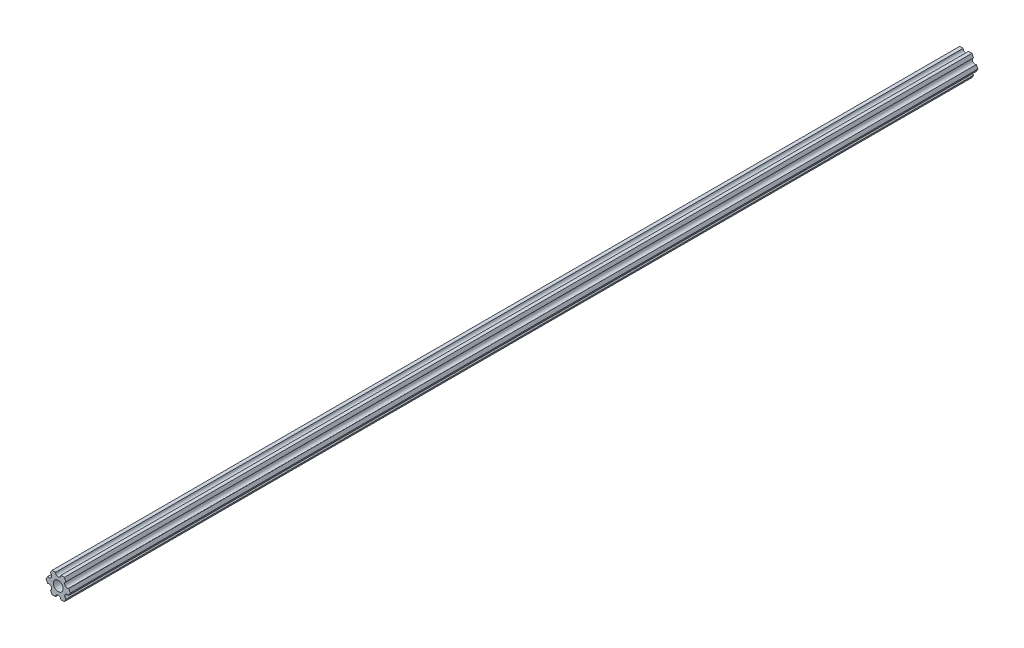
ISO-10303-21;
HEADER;
FILE_DESCRIPTION(('STEP AP214'),'2;1');
FILE_NAME('part.step','',(''),(''),'','','');
FILE_SCHEMA(('AUTOMOTIVE_DESIGN { 1 0 10303 214 1 1 1 1 }'));
ENDSEC;
DATA;
#1=APPLICATION_CONTEXT('core data for automotive mechanical design processes');
#2=APPLICATION_PROTOCOL_DEFINITION('international standard','automotive_design',2000,#1);
#3=PRODUCT_CONTEXT('',#1,'mechanical');
#4=PRODUCT('Part','Part','',(#3));
#5=PRODUCT_RELATED_PRODUCT_CATEGORY('part','',(#4));
#6=PRODUCT_DEFINITION_FORMATION('','',#4);
#7=PRODUCT_DEFINITION_CONTEXT('part definition',#1,'design');
#8=PRODUCT_DEFINITION('design','',#6,#7);
#9=PRODUCT_DEFINITION_SHAPE('','',#8);
#10=(LENGTH_UNIT() NAMED_UNIT(*) SI_UNIT(.MILLI.,.METRE.));
#11=(NAMED_UNIT(*) PLANE_ANGLE_UNIT() SI_UNIT($,.RADIAN.));
#12=(NAMED_UNIT(*) SI_UNIT($,.STERADIAN.) SOLID_ANGLE_UNIT());
#13=UNCERTAINTY_MEASURE_WITH_UNIT(LENGTH_MEASURE(1.E-05),#10,'distance_accuracy_value','');
#14=(GEOMETRIC_REPRESENTATION_CONTEXT(3) GLOBAL_UNCERTAINTY_ASSIGNED_CONTEXT((#13)) GLOBAL_UNIT_ASSIGNED_CONTEXT((#10,
#11,#12)) REPRESENTATION_CONTEXT('',''));
#15=CARTESIAN_POINT('',(0.,0.,0.));
#16=DIRECTION('',(0.,0.,1.));
#17=DIRECTION('',(1.,0.,0.));
#18=AXIS2_PLACEMENT_3D('',#15,#16,#17);
#19=CARTESIAN_POINT('',(5.49926150638083,-3.17499966684068,546.1));
#20=DIRECTION('',(0.,0.,-1.));
#21=DIRECTION('',(-1.,0.,0.));
#22=AXIS2_PLACEMENT_3D('',#19,#20,#21);
#23=CYLINDRICAL_SURFACE('',#22,1.58750000000001);
#24=CARTESIAN_POINT('',(5.49926150638083,-3.17499966684068,0.));
#25=DIRECTION('',(0.,0.,1.));
#26=DIRECTION('',(1.,0.,0.));
#27=AXIS2_PLACEMENT_3D('',#24,#25,#26);
#28=CIRCLE('',#27,1.58750000000001);
#29=CARTESIAN_POINT('',(6.29301142309098,-1.80018429024546,0.));
#30=VERTEX_POINT('',#29);
#31=CARTESIAN_POINT('',(4.70551158967068,-4.54981504343589,0.));
#32=VERTEX_POINT('',#31);
#33=EDGE_CURVE('E189',#30,#32,#28,.T.);
#34=ORIENTED_EDGE('',*,*,#33,.F.);
#35=DIRECTION('',(0.,0.,-1.));
#36=VECTOR('',#35,1.);
#37=CARTESIAN_POINT('',(6.29301142309098,-1.80018429024546,546.1));
#38=LINE('',#37,#36);
#39=CARTESIAN_POINT('',(6.29301142309098,-1.80018429024546,546.1));
#40=VERTEX_POINT('',#39);
#41=EDGE_CURVE('E11',#40,#30,#38,.T.);
#42=ORIENTED_EDGE('',*,*,#41,.F.);
#43=CARTESIAN_POINT('',(5.49926150638083,-3.17499966684068,546.1));
#44=DIRECTION('',(0.,0.,1.));
#45=DIRECTION('',(1.,0.,0.));
#46=AXIS2_PLACEMENT_3D('',#43,#44,#45);
#47=CIRCLE('',#46,1.58750000000001);
#48=CARTESIAN_POINT('',(4.70551158967068,-4.54981504343589,546.1));
#49=VERTEX_POINT('',#48);
#50=EDGE_CURVE('E240',#40,#49,#47,.T.);
#51=ORIENTED_EDGE('',*,*,#50,.T.);
#52=DIRECTION('',(0.,0.,-1.));
#53=VECTOR('',#52,1.);
#54=CARTESIAN_POINT('',(4.70551158967068,-4.54981504343589,546.1));
#55=LINE('',#54,#53);
#56=EDGE_CURVE('E35',#49,#32,#55,.T.);
#57=ORIENTED_EDGE('',*,*,#56,.T.);
#58=EDGE_LOOP('',(#34,#42,#51,#57));
#59=FACE_BOUND('',#58,.T.);
#60=ADVANCED_FACE('F32',(#59),#23,.F.);
#61=CARTESIAN_POINT('',(7.33234841870826,4.44212518856872E-07,546.1));
#62=DIRECTION('',(0.866025434075723,-0.499999947533953,0.));
#63=DIRECTION('',(0.499999947533953,0.866025434075723,0.));
#64=AXIS2_PLACEMENT_3D('',#61,#62,#63);
#65=PLANE('',#64);
#66=DIRECTION('',(-0.499999947533953,-0.866025434075723,0.));
#67=VECTOR('',#66,1.);
#68=CARTESIAN_POINT('',(7.33234841870826,4.44212518856872E-07,0.));
#69=LINE('',#68,#67);
#70=CARTESIAN_POINT('',(7.33234841870826,4.44212518856872E-07,0.));
#71=VERTEX_POINT('',#70);
#72=EDGE_CURVE('E238',#71,#30,#69,.T.);
#73=ORIENTED_EDGE('',*,*,#72,.F.);
#74=DIRECTION('',(0.,0.,-1.));
#75=VECTOR('',#74,1.);
#76=CARTESIAN_POINT('',(7.33234841870826,4.44212518856872E-07,546.1));
#77=LINE('',#76,#75);
#78=CARTESIAN_POINT('',(7.33234841870826,4.44212518856872E-07,546.1));
#79=VERTEX_POINT('',#78);
#80=EDGE_CURVE('E41',#79,#71,#77,.T.);
#81=ORIENTED_EDGE('',*,*,#80,.F.);
#82=DIRECTION('',(-0.499999947533953,-0.866025434075723,0.));
#83=VECTOR('',#82,1.);
#84=CARTESIAN_POINT('',(7.33234841870826,4.44212518856872E-07,546.1));
#85=LINE('',#84,#83);
#86=EDGE_CURVE('E179',#79,#40,#85,.T.);
#87=ORIENTED_EDGE('',*,*,#86,.T.);
#88=ORIENTED_EDGE('',*,*,#41,.T.);
#89=EDGE_LOOP('',(#73,#81,#87,#88));
#90=FACE_BOUND('',#89,.T.);
#91=ADVANCED_FACE('F272',(#90),#65,.T.);
#92=CARTESIAN_POINT('',(6.29301120497139,1.80018505273895,546.1));
#93=DIRECTION('',(0.866025373493145,0.500000052466056,0.));
#94=DIRECTION('',(-0.500000052466056,0.866025373493145,0.));
#95=AXIS2_PLACEMENT_3D('',#92,#93,#94);
#96=PLANE('',#95);
#97=DIRECTION('',(0.500000052466056,-0.866025373493145,0.));
#98=VECTOR('',#97,1.);
#99=CARTESIAN_POINT('',(6.29301120497139,1.80018505273895,0.));
#100=LINE('',#99,#98);
#101=CARTESIAN_POINT('',(6.29301120497139,1.80018505273895,0.));
#102=VERTEX_POINT('',#101);
#103=EDGE_CURVE('E166',#102,#71,#100,.T.);
#104=ORIENTED_EDGE('',*,*,#103,.F.);
#105=DIRECTION('',(0.,0.,-1.));
#106=VECTOR('',#105,1.);
#107=CARTESIAN_POINT('',(6.29301120497139,1.80018505273895,546.1));
#108=LINE('',#107,#106);
#109=CARTESIAN_POINT('',(6.29301120497139,1.80018505273895,546.1));
#110=VERTEX_POINT('',#109);
#111=EDGE_CURVE('E161',#110,#102,#108,.T.);
#112=ORIENTED_EDGE('',*,*,#111,.F.);
#113=DIRECTION('',(0.500000052466056,-0.866025373493145,0.));
#114=VECTOR('',#113,1.);
#115=CARTESIAN_POINT('',(6.29301120497139,1.80018505273895,546.1));
#116=LINE('',#115,#114);
#117=EDGE_CURVE('E164',#110,#79,#116,.T.);
#118=ORIENTED_EDGE('',*,*,#117,.T.);
#119=ORIENTED_EDGE('',*,*,#80,.T.);
#120=EDGE_LOOP('',(#104,#112,#118,#119));
#121=FACE_BOUND('',#120,.T.);
#122=ADVANCED_FACE('F163',(#121),#96,.T.);
#123=CARTESIAN_POINT('',(5.49926112168152,3.17500033315931,546.1));
#124=DIRECTION('',(0.,0.,-1.));
#125=DIRECTION('',(-1.,0.,0.));
#126=AXIS2_PLACEMENT_3D('',#123,#124,#125);
#127=CYLINDRICAL_SURFACE('',#126,1.5875);
#128=CARTESIAN_POINT('',(5.49926112168152,3.17500033315931,0.));
#129=DIRECTION('',(0.,0.,1.));
#130=DIRECTION('',(1.,0.,0.));
#131=AXIS2_PLACEMENT_3D('',#128,#129,#130);
#132=CIRCLE('',#131,1.5875);
#133=CARTESIAN_POINT('',(4.70551103839166,4.54981561357968,0.));
#134=VERTEX_POINT('',#133);
#135=EDGE_CURVE('E235',#134,#102,#132,.T.);
#136=ORIENTED_EDGE('',*,*,#135,.F.);
#137=DIRECTION('',(0.,0.,-1.));
#138=VECTOR('',#137,1.);
#139=CARTESIAN_POINT('',(4.70551103839166,4.54981561357968,546.1));
#140=LINE('',#139,#138);
#141=CARTESIAN_POINT('',(4.70551103839166,4.54981561357968,546.1));
#142=VERTEX_POINT('',#141);
#143=EDGE_CURVE('E171',#142,#134,#140,.T.);
#144=ORIENTED_EDGE('',*,*,#143,.F.);
#145=CARTESIAN_POINT('',(5.49926112168152,3.17500033315931,546.1));
#146=DIRECTION('',(0.,0.,1.));
#147=DIRECTION('',(1.,0.,0.));
#148=AXIS2_PLACEMENT_3D('',#145,#146,#147);
#149=CIRCLE('',#148,1.5875);
#150=EDGE_CURVE('E177',#142,#110,#149,.T.);
#151=ORIENTED_EDGE('',*,*,#150,.T.);
#152=ORIENTED_EDGE('',*,*,#111,.T.);
#153=EDGE_LOOP('',(#136,#144,#151,#152));
#154=FACE_BOUND('',#153,.T.);
#155=ADVANCED_FACE('F181',(#154),#127,.F.);
#156=CARTESIAN_POINT('',(3.66617382465472,6.35000022210622,546.1));
#157=DIRECTION('',(0.866025373493145,0.500000052466056,0.));
#158=DIRECTION('',(-0.500000052466056,0.866025373493145,0.));
#159=AXIS2_PLACEMENT_3D('',#156,#157,#158);
#160=PLANE('',#159);
#161=DIRECTION('',(0.500000052466056,-0.866025373493145,0.));
#162=VECTOR('',#161,1.);
#163=CARTESIAN_POINT('',(3.66617382465472,6.35000022210622,0.));
#164=LINE('',#163,#162);
#165=CARTESIAN_POINT('',(3.66617382465472,6.35000022210622,0.));
#166=VERTEX_POINT('',#165);
#167=EDGE_CURVE('E232',#166,#134,#164,.T.);
#168=ORIENTED_EDGE('',*,*,#167,.F.);
#169=DIRECTION('',(0.,0.,-1.));
#170=VECTOR('',#169,1.);
#171=CARTESIAN_POINT('',(3.66617382465472,6.35000022210622,546.1));
#172=LINE('',#171,#170);
#173=CARTESIAN_POINT('',(3.66617382465472,6.35000022210622,546.1));
#174=VERTEX_POINT('',#173);
#175=EDGE_CURVE('E244',#174,#166,#172,.T.);
#176=ORIENTED_EDGE('',*,*,#175,.F.);
#177=DIRECTION('',(0.500000052466056,-0.866025373493145,0.));
#178=VECTOR('',#177,1.);
#179=CARTESIAN_POINT('',(3.66617382465472,6.35000022210622,546.1));
#180=LINE('',#179,#178);
#181=EDGE_CURVE('E182',#174,#142,#180,.T.);
#182=ORIENTED_EDGE('',*,*,#181,.T.);
#183=ORIENTED_EDGE('',*,*,#143,.T.);
#184=EDGE_LOOP('',(#168,#176,#182,#183));
#185=FACE_BOUND('',#184,.T.);
#186=ADVANCED_FACE('F285',(#185),#160,.T.);
#187=CARTESIAN_POINT('',(1.58749961530066,6.35000022210623,546.1));
#188=DIRECTION('',(0.,1.,0.));
#189=DIRECTION('',(-1.,0.,0.));
#190=AXIS2_PLACEMENT_3D('',#187,#188,#189);
#191=PLANE('',#190);
#192=DIRECTION('',(1.,0.,0.));
#193=VECTOR('',#192,1.);
#194=CARTESIAN_POINT('',(1.58749961530066,6.35000022210623,0.));
#195=LINE('',#194,#193);
#196=CARTESIAN_POINT('',(1.58749961530066,6.35000022210623,0.));
#197=VERTEX_POINT('',#196);
#198=EDGE_CURVE('E229',#197,#166,#195,.T.);
#199=ORIENTED_EDGE('',*,*,#198,.F.);
#200=DIRECTION('',(0.,0.,-1.));
#201=VECTOR('',#200,1.);
#202=CARTESIAN_POINT('',(1.58749961530066,6.35000022210623,546.1));
#203=LINE('',#202,#201);
#204=CARTESIAN_POINT('',(1.58749961530066,6.35000022210623,546.1));
#205=VERTEX_POINT('',#204);
#206=EDGE_CURVE('E246',#205,#197,#203,.T.);
#207=ORIENTED_EDGE('',*,*,#206,.F.);
#208=DIRECTION('',(1.,0.,0.));
#209=VECTOR('',#208,1.);
#210=CARTESIAN_POINT('',(1.58749961530066,6.35000022210623,546.1));
#211=LINE('',#210,#209);
#212=EDGE_CURVE('E184',#205,#174,#211,.T.);
#213=ORIENTED_EDGE('',*,*,#212,.T.);
#214=ORIENTED_EDGE('',*,*,#175,.T.);
#215=EDGE_LOOP('',(#199,#207,#213,#214));
#216=FACE_BOUND('',#215,.T.);
#217=ADVANCED_FACE('F288',(#216),#191,.T.);
#218=CARTESIAN_POINT('',(-3.84699344941095E-07,6.35000022210623,546.1));
#219=DIRECTION('',(0.,0.,-1.));
#220=DIRECTION('',(-1.,0.,0.));
#221=AXIS2_PLACEMENT_3D('',#218,#219,#220);
#222=CYLINDRICAL_SURFACE('',#221,1.5875);
#223=CARTESIAN_POINT('',(-3.84699344941095E-07,6.35000022210623,0.));
#224=DIRECTION('',(0.,0.,1.));
#225=DIRECTION('',(1.,0.,0.));
#226=AXIS2_PLACEMENT_3D('',#223,#224,#225);
#227=CIRCLE('',#226,1.5875);
#228=CARTESIAN_POINT('',(-1.58750038469935,6.35000022210623,0.));
#229=VERTEX_POINT('',#228);
#230=EDGE_CURVE('E226',#229,#197,#227,.T.);
#231=ORIENTED_EDGE('',*,*,#230,.F.);
#232=DIRECTION('',(0.,0.,-1.));
#233=VECTOR('',#232,1.);
#234=CARTESIAN_POINT('',(-1.58750038469935,6.35000022210623,546.1));
#235=LINE('',#234,#233);
#236=CARTESIAN_POINT('',(-1.58750038469935,6.35000022210623,546.1));
#237=VERTEX_POINT('',#236);
#238=EDGE_CURVE('E248',#237,#229,#235,.T.);
#239=ORIENTED_EDGE('',*,*,#238,.F.);
#240=CARTESIAN_POINT('',(-3.84699344941095E-07,6.35000022210623,546.1));
#241=DIRECTION('',(0.,0.,1.));
#242=DIRECTION('',(1.,0.,0.));
#243=AXIS2_PLACEMENT_3D('',#240,#241,#242);
#244=CIRCLE('',#243,1.5875);
#245=EDGE_CURVE('E393',#237,#205,#244,.T.);
#246=ORIENTED_EDGE('',*,*,#245,.T.);
#247=ORIENTED_EDGE('',*,*,#206,.T.);
#248=EDGE_LOOP('',(#231,#239,#246,#247));
#249=FACE_BOUND('',#248,.T.);
#250=ADVANCED_FACE('F292',(#249),#222,.F.);
#251=CARTESIAN_POINT('',(-3.66617452134701,6.35000022210623,546.1));
#252=DIRECTION('',(0.,1.,0.));
#253=DIRECTION('',(0.,0.,1.));
#254=AXIS2_PLACEMENT_3D('',#251,#252,#253);
#255=PLANE('',#254);
#256=DIRECTION('',(1.,0.,0.));
#257=VECTOR('',#256,1.);
#258=CARTESIAN_POINT('',(-3.66617452134701,6.35000022210623,0.));
#259=LINE('',#258,#257);
#260=CARTESIAN_POINT('',(-3.66617452134701,6.35000022210623,0.));
#261=VERTEX_POINT('',#260);
#262=EDGE_CURVE('E223',#261,#229,#259,.T.);
#263=ORIENTED_EDGE('',*,*,#262,.F.);
#264=DIRECTION('',(0.,0.,-1.));
#265=VECTOR('',#264,1.);
#266=CARTESIAN_POINT('',(-3.66617452134701,6.35000022210623,546.1));
#267=LINE('',#266,#265);
#268=CARTESIAN_POINT('',(-3.66617452134701,6.35000022210623,546.1));
#269=VERTEX_POINT('',#268);
#270=EDGE_CURVE('E250',#269,#261,#267,.T.);
#271=ORIENTED_EDGE('',*,*,#270,.F.);
#272=DIRECTION('',(1.,0.,0.));
#273=VECTOR('',#272,1.);
#274=CARTESIAN_POINT('',(-3.66617452134701,6.35000022210623,546.1));
#275=LINE('',#274,#273);
#276=EDGE_CURVE('E390',#269,#237,#275,.T.);
#277=ORIENTED_EDGE('',*,*,#276,.T.);
#278=ORIENTED_EDGE('',*,*,#238,.T.);
#279=EDGE_LOOP('',(#263,#271,#277,#278));
#280=FACE_BOUND('',#279,.T.);
#281=ADVANCED_FACE('F296',(#280),#255,.T.);
#282=CARTESIAN_POINT('',(-4.70551145677116,4.54981548085265,546.1));
#283=DIRECTION('',(-0.866025447431971,0.499999924400249,0.));
#284=DIRECTION('',(-0.499999924400249,-0.866025447431971,0.));
#285=AXIS2_PLACEMENT_3D('',#282,#283,#284);
#286=PLANE('',#285);
#287=DIRECTION('',(0.499999924400249,0.866025447431971,0.));
#288=VECTOR('',#287,1.);
#289=CARTESIAN_POINT('',(-4.70551145677116,4.54981548085265,0.));
#290=LINE('',#289,#288);
#291=CARTESIAN_POINT('',(-4.70551145677116,4.54981548085265,0.));
#292=VERTEX_POINT('',#291);
#293=EDGE_CURVE('E220',#292,#261,#290,.T.);
#294=ORIENTED_EDGE('',*,*,#293,.F.);
#295=DIRECTION('',(0.,0.,-1.));
#296=VECTOR('',#295,1.);
#297=CARTESIAN_POINT('',(-4.70551145677116,4.54981548085265,546.1));
#298=LINE('',#297,#296);
#299=CARTESIAN_POINT('',(-4.70551145677116,4.54981548085265,546.1));
#300=VERTEX_POINT('',#299);
#301=EDGE_CURVE('E252',#300,#292,#298,.T.);
#302=ORIENTED_EDGE('',*,*,#301,.F.);
#303=DIRECTION('',(0.499999924400249,0.866025447431971,0.));
#304=VECTOR('',#303,1.);
#305=CARTESIAN_POINT('',(-4.70551145677116,4.54981548085265,546.1));
#306=LINE('',#305,#304);
#307=EDGE_CURVE('E387',#300,#269,#306,.T.);
#308=ORIENTED_EDGE('',*,*,#307,.T.);
#309=ORIENTED_EDGE('',*,*,#270,.T.);
#310=EDGE_LOOP('',(#294,#302,#308,#309));
#311=FACE_BOUND('',#310,.T.);
#312=ADVANCED_FACE('F300',(#311),#286,.T.);
#313=CARTESIAN_POINT('',(-5.49926133675655,3.17500008305439,546.1));
#314=DIRECTION('',(0.,0.,-1.));
#315=DIRECTION('',(-1.,0.,0.));
#316=AXIS2_PLACEMENT_3D('',#313,#314,#315);
#317=CYLINDRICAL_SURFACE('',#316,1.5875);
#318=CARTESIAN_POINT('',(-5.49926133675655,3.17500008305439,0.));
#319=DIRECTION('',(0.,0.,1.));
#320=DIRECTION('',(1.,0.,0.));
#321=AXIS2_PLACEMENT_3D('',#318,#319,#320);
#322=CIRCLE('',#321,1.5875);
#323=CARTESIAN_POINT('',(-6.29301121674195,1.80018468525613,0.));
#324=VERTEX_POINT('',#323);
#325=EDGE_CURVE('E217',#324,#292,#322,.T.);
#326=ORIENTED_EDGE('',*,*,#325,.F.);
#327=DIRECTION('',(0.,0.,-1.));
#328=VECTOR('',#327,1.);
#329=CARTESIAN_POINT('',(-6.29301121674195,1.80018468525613,546.1));
#330=LINE('',#329,#328);
#331=CARTESIAN_POINT('',(-6.29301121674195,1.80018468525613,546.1));
#332=VERTEX_POINT('',#331);
#333=EDGE_CURVE('E254',#332,#324,#330,.T.);
#334=ORIENTED_EDGE('',*,*,#333,.F.);
#335=CARTESIAN_POINT('',(-5.49926133675655,3.17500008305439,546.1));
#336=DIRECTION('',(0.,0.,1.));
#337=DIRECTION('',(1.,0.,0.));
#338=AXIS2_PLACEMENT_3D('',#335,#336,#337);
#339=CIRCLE('',#338,1.5875);
#340=EDGE_CURVE('E384',#332,#300,#339,.T.);
#341=ORIENTED_EDGE('',*,*,#340,.T.);
#342=ORIENTED_EDGE('',*,*,#301,.T.);
#343=EDGE_LOOP('',(#326,#334,#341,#342));
#344=FACE_BOUND('',#343,.T.);
#345=ADVANCED_FACE('F304',(#344),#317,.F.);
#346=CARTESIAN_POINT('',(-7.33234807945963,6.99338729030344E-08,546.1));
#347=DIRECTION('',(-0.866025447431971,0.499999924400249,0.));
#348=DIRECTION('',(-0.499999924400249,-0.866025447431971,0.));
#349=AXIS2_PLACEMENT_3D('',#346,#347,#348);
#350=PLANE('',#349);
#351=DIRECTION('',(0.499999924400249,0.866025447431971,0.));
#352=VECTOR('',#351,1.);
#353=CARTESIAN_POINT('',(-7.33234807945963,6.99338729030344E-08,0.));
#354=LINE('',#353,#352);
#355=CARTESIAN_POINT('',(-7.33234807945963,6.99338729030344E-08,0.));
#356=VERTEX_POINT('',#355);
#357=EDGE_CURVE('E214',#356,#324,#354,.T.);
#358=ORIENTED_EDGE('',*,*,#357,.F.);
#359=DIRECTION('',(0.,0.,-1.));
#360=VECTOR('',#359,1.);
#361=CARTESIAN_POINT('',(-7.33234807945963,6.99338729030344E-08,546.1));
#362=LINE('',#361,#360);
#363=CARTESIAN_POINT('',(-7.33234807945963,6.99338729030344E-08,546.1));
#364=VERTEX_POINT('',#363);
#365=EDGE_CURVE('E256',#364,#356,#362,.T.);
#366=ORIENTED_EDGE('',*,*,#365,.F.);
#367=DIRECTION('',(0.499999924400249,0.866025447431971,0.));
#368=VECTOR('',#367,1.);
#369=CARTESIAN_POINT('',(-7.33234807945963,6.99338729030344E-08,546.1));
#370=LINE('',#369,#368);
#371=EDGE_CURVE('E381',#364,#332,#370,.T.);
#372=ORIENTED_EDGE('',*,*,#371,.T.);
#373=ORIENTED_EDGE('',*,*,#333,.T.);
#374=EDGE_LOOP('',(#358,#366,#372,#373));
#375=FACE_BOUND('',#374,.T.);
#376=ADVANCED_FACE('F308',(#375),#350,.T.);
#377=CARTESIAN_POINT('',(-6.29301096189761,-1.80018459411914,546.1));
#378=DIRECTION('',(-0.866025400205645,-0.500000006198653,0.));
#379=DIRECTION('',(0.500000006198653,-0.866025400205645,0.));
#380=AXIS2_PLACEMENT_3D('',#377,#378,#379);
#381=PLANE('',#380);
#382=DIRECTION('',(-0.500000006198653,0.866025400205645,0.));
#383=VECTOR('',#382,1.);
#384=CARTESIAN_POINT('',(-6.29301096189761,-1.80018459411914,0.));
#385=LINE('',#384,#383);
#386=CARTESIAN_POINT('',(-6.29301096189761,-1.80018459411914,0.));
#387=VERTEX_POINT('',#386);
#388=EDGE_CURVE('E211',#387,#356,#385,.T.);
#389=ORIENTED_EDGE('',*,*,#388,.F.);
#390=DIRECTION('',(0.,0.,-1.));
#391=VECTOR('',#390,1.);
#392=CARTESIAN_POINT('',(-6.29301096189761,-1.80018459411914,546.1));
#393=LINE('',#392,#391);
#394=CARTESIAN_POINT('',(-6.29301096189761,-1.80018459411914,546.1));
#395=VERTEX_POINT('',#394);
#396=EDGE_CURVE('E258',#395,#387,#393,.T.);
#397=ORIENTED_EDGE('',*,*,#396,.F.);
#398=DIRECTION('',(-0.500000006198653,0.866025400205645,0.));
#399=VECTOR('',#398,1.);
#400=CARTESIAN_POINT('',(-6.29301096189761,-1.80018459411914,546.1));
#401=LINE('',#400,#399);
#402=EDGE_CURVE('E378',#395,#364,#401,.T.);
#403=ORIENTED_EDGE('',*,*,#402,.T.);
#404=ORIENTED_EDGE('',*,*,#365,.T.);
#405=EDGE_LOOP('',(#389,#397,#403,#404));
#406=FACE_BOUND('',#405,.T.);
#407=ADVANCED_FACE('F312',(#406),#381,.T.);
#408=CARTESIAN_POINT('',(-5.49926095205725,-3.1749999169456,546.1));
#409=DIRECTION('',(0.,0.,-1.));
#410=DIRECTION('',(-1.,0.,0.));
#411=AXIS2_PLACEMENT_3D('',#408,#409,#410);
#412=CYLINDRICAL_SURFACE('',#411,1.5875);
#413=CARTESIAN_POINT('',(-5.49926095205725,-3.1749999169456,0.));
#414=DIRECTION('',(0.,0.,1.));
#415=DIRECTION('',(1.,0.,0.));
#416=AXIS2_PLACEMENT_3D('',#413,#414,#415);
#417=CIRCLE('',#416,1.5875);
#418=CARTESIAN_POINT('',(-4.70551094221689,-4.54981523977206,0.));
#419=VERTEX_POINT('',#418);
#420=EDGE_CURVE('E208',#419,#387,#417,.T.);
#421=ORIENTED_EDGE('',*,*,#420,.F.);
#422=DIRECTION('',(0.,0.,-1.));
#423=VECTOR('',#422,1.);
#424=CARTESIAN_POINT('',(-4.70551094221689,-4.54981523977206,546.1));
#425=LINE('',#424,#423);
#426=CARTESIAN_POINT('',(-4.70551094221689,-4.54981523977206,546.1));
#427=VERTEX_POINT('',#426);
#428=EDGE_CURVE('E260',#427,#419,#425,.T.);
#429=ORIENTED_EDGE('',*,*,#428,.F.);
#430=CARTESIAN_POINT('',(-5.49926095205725,-3.1749999169456,546.1));
#431=DIRECTION('',(0.,0.,1.));
#432=DIRECTION('',(1.,0.,0.));
#433=AXIS2_PLACEMENT_3D('',#430,#431,#432);
#434=CIRCLE('',#433,1.5875);
#435=EDGE_CURVE('E375',#427,#395,#434,.T.);
#436=ORIENTED_EDGE('',*,*,#435,.T.);
#437=ORIENTED_EDGE('',*,*,#396,.T.);
#438=EDGE_LOOP('',(#421,#429,#436,#437));
#439=FACE_BOUND('',#438,.T.);
#440=ADVANCED_FACE('F316',(#439),#412,.F.);
#441=CARTESIAN_POINT('',(-3.66617382465481,-6.34999990382519,546.1));
#442=DIRECTION('',(-0.866025400205645,-0.500000006198653,0.));
#443=DIRECTION('',(0.500000006198653,-0.866025400205645,0.));
#444=AXIS2_PLACEMENT_3D('',#441,#442,#443);
#445=PLANE('',#444);
#446=DIRECTION('',(-0.500000006198653,0.866025400205644,0.));
#447=VECTOR('',#446,1.);
#448=CARTESIAN_POINT('',(-3.66617382465481,-6.34999990382519,0.));
#449=LINE('',#448,#447);
#450=CARTESIAN_POINT('',(-3.66617382465481,-6.34999990382519,0.));
#451=VERTEX_POINT('',#450);
#452=EDGE_CURVE('E205',#451,#419,#449,.T.);
#453=ORIENTED_EDGE('',*,*,#452,.F.);
#454=DIRECTION('',(0.,0.,-1.));
#455=VECTOR('',#454,1.);
#456=CARTESIAN_POINT('',(-3.66617382465481,-6.34999990382519,546.1));
#457=LINE('',#456,#455);
#458=CARTESIAN_POINT('',(-3.66617382465481,-6.34999990382519,546.1));
#459=VERTEX_POINT('',#458);
#460=EDGE_CURVE('E262',#459,#451,#457,.T.);
#461=ORIENTED_EDGE('',*,*,#460,.F.);
#462=DIRECTION('',(-0.500000006198653,0.866025400205644,0.));
#463=VECTOR('',#462,1.);
#464=CARTESIAN_POINT('',(-3.66617382465481,-6.34999990382519,546.1));
#465=LINE('',#464,#463);
#466=EDGE_CURVE('E372',#459,#427,#465,.T.);
#467=ORIENTED_EDGE('',*,*,#466,.T.);
#468=ORIENTED_EDGE('',*,*,#428,.T.);
#469=EDGE_LOOP('',(#453,#461,#467,#468));
#470=FACE_BOUND('',#469,.T.);
#471=ADVANCED_FACE('F320',(#470),#445,.T.);
#472=CARTESIAN_POINT('',(-1.58749961530074,-6.34999990382519,546.1));
#473=DIRECTION('',(0.,-1.,0.));
#474=DIRECTION('',(1.,0.,0.));
#475=AXIS2_PLACEMENT_3D('',#472,#473,#474);
#476=PLANE('',#475);
#477=DIRECTION('',(-1.,0.,0.));
#478=VECTOR('',#477,1.);
#479=CARTESIAN_POINT('',(-1.58749961530074,-6.34999990382519,0.));
#480=LINE('',#479,#478);
#481=CARTESIAN_POINT('',(-1.58749961530074,-6.34999990382519,0.));
#482=VERTEX_POINT('',#481);
#483=EDGE_CURVE('E202',#482,#451,#480,.T.);
#484=ORIENTED_EDGE('',*,*,#483,.F.);
#485=DIRECTION('',(0.,0.,-1.));
#486=VECTOR('',#485,1.);
#487=CARTESIAN_POINT('',(-1.58749961530074,-6.34999990382519,546.1));
#488=LINE('',#487,#486);
#489=CARTESIAN_POINT('',(-1.58749961530074,-6.34999990382519,546.1));
#490=VERTEX_POINT('',#489);
#491=EDGE_CURVE('E264',#490,#482,#488,.T.);
#492=ORIENTED_EDGE('',*,*,#491,.F.);
#493=DIRECTION('',(-1.,0.,0.));
#494=VECTOR('',#493,1.);
#495=CARTESIAN_POINT('',(-1.58749961530074,-6.34999990382519,546.1));
#496=LINE('',#495,#494);
#497=EDGE_CURVE('E369',#490,#459,#496,.T.);
#498=ORIENTED_EDGE('',*,*,#497,.T.);
#499=ORIENTED_EDGE('',*,*,#460,.T.);
#500=EDGE_LOOP('',(#484,#492,#498,#499));
#501=FACE_BOUND('',#500,.T.);
#502=ADVANCED_FACE('F324',(#501),#476,.T.);
#503=CARTESIAN_POINT('',(3.8469926204343E-07,-6.34999990382519,546.1));
#504=DIRECTION('',(0.,0.,-1.));
#505=DIRECTION('',(-1.,0.,0.));
#506=AXIS2_PLACEMENT_3D('',#503,#504,#505);
#507=CYLINDRICAL_SURFACE('',#506,1.5875);
#508=CARTESIAN_POINT('',(3.8469926204343E-07,-6.34999990382519,0.));
#509=DIRECTION('',(0.,0.,1.));
#510=DIRECTION('',(1.,0.,0.));
#511=AXIS2_PLACEMENT_3D('',#508,#509,#510);
#512=CIRCLE('',#511,1.5875);
#513=CARTESIAN_POINT('',(1.58750038469926,-6.34999990382518,0.));
#514=VERTEX_POINT('',#513);
#515=EDGE_CURVE('E199',#514,#482,#512,.T.);
#516=ORIENTED_EDGE('',*,*,#515,.F.);
#517=DIRECTION('',(0.,0.,-1.));
#518=VECTOR('',#517,1.);
#519=CARTESIAN_POINT('',(1.58750038469926,-6.34999990382518,546.1));
#520=LINE('',#519,#518);
#521=CARTESIAN_POINT('',(1.58750038469926,-6.34999990382518,546.1));
#522=VERTEX_POINT('',#521);
#523=EDGE_CURVE('E266',#522,#514,#520,.T.);
#524=ORIENTED_EDGE('',*,*,#523,.F.);
#525=CARTESIAN_POINT('',(3.8469926204343E-07,-6.34999990382519,546.1));
#526=DIRECTION('',(0.,0.,1.));
#527=DIRECTION('',(1.,0.,0.));
#528=AXIS2_PLACEMENT_3D('',#525,#526,#527);
#529=CIRCLE('',#528,1.5875);
#530=EDGE_CURVE('E366',#522,#490,#529,.T.);
#531=ORIENTED_EDGE('',*,*,#530,.T.);
#532=ORIENTED_EDGE('',*,*,#491,.T.);
#533=EDGE_LOOP('',(#516,#524,#531,#532));
#534=FACE_BOUND('',#533,.T.);
#535=ADVANCED_FACE('F328',(#534),#507,.F.);
#536=CARTESIAN_POINT('',(3.66617452134693,-6.34999990382519,546.1));
#537=DIRECTION('',(0.,-1.,0.));
#538=DIRECTION('',(1.,0.,0.));
#539=AXIS2_PLACEMENT_3D('',#536,#537,#538);
#540=PLANE('',#539);
#541=DIRECTION('',(-1.,0.,0.));
#542=VECTOR('',#541,1.);
#543=CARTESIAN_POINT('',(3.66617452134693,-6.34999990382519,0.));
#544=LINE('',#543,#542);
#545=CARTESIAN_POINT('',(3.66617452134693,-6.34999990382519,0.));
#546=VERTEX_POINT('',#545);
#547=EDGE_CURVE('E196',#546,#514,#544,.T.);
#548=ORIENTED_EDGE('',*,*,#547,.F.);
#549=DIRECTION('',(0.,0.,-1.));
#550=VECTOR('',#549,1.);
#551=CARTESIAN_POINT('',(3.66617452134693,-6.34999990382519,546.1));
#552=LINE('',#551,#550);
#553=CARTESIAN_POINT('',(3.66617452134693,-6.34999990382519,546.1));
#554=VERTEX_POINT('',#553);
#555=EDGE_CURVE('E267',#554,#546,#552,.T.);
#556=ORIENTED_EDGE('',*,*,#555,.F.);
#557=DIRECTION('',(-1.,0.,0.));
#558=VECTOR('',#557,1.);
#559=CARTESIAN_POINT('',(3.66617452134693,-6.34999990382519,546.1));
#560=LINE('',#559,#558);
#561=EDGE_CURVE('E363',#554,#522,#560,.T.);
#562=ORIENTED_EDGE('',*,*,#561,.T.);
#563=ORIENTED_EDGE('',*,*,#523,.T.);
#564=EDGE_LOOP('',(#548,#556,#562,#563));
#565=FACE_BOUND('',#564,.T.);
#566=ADVANCED_FACE('F332',(#565),#540,.T.);
#567=CARTESIAN_POINT('',(4.70551158967068,-4.54981504343589,546.1));
#568=DIRECTION('',(0.866025434075723,-0.499999947533953,0.));
#569=DIRECTION('',(0.499999947533953,0.866025434075723,0.));
#570=AXIS2_PLACEMENT_3D('',#567,#568,#569);
#571=PLANE('',#570);
#572=DIRECTION('',(-0.499999947533953,-0.866025434075723,0.));
#573=VECTOR('',#572,1.);
#574=CARTESIAN_POINT('',(4.70551158967068,-4.54981504343589,0.));
#575=LINE('',#574,#573);
#576=EDGE_CURVE('E192',#32,#546,#575,.T.);
#577=ORIENTED_EDGE('',*,*,#576,.F.);
#578=ORIENTED_EDGE('',*,*,#56,.F.);
#579=DIRECTION('',(-0.499999947533953,-0.866025434075723,0.));
#580=VECTOR('',#579,1.);
#581=CARTESIAN_POINT('',(4.70551158967068,-4.54981504343589,546.1));
#582=LINE('',#581,#580);
#583=EDGE_CURVE('E361',#49,#554,#582,.T.);
#584=ORIENTED_EDGE('',*,*,#583,.T.);
#585=ORIENTED_EDGE('',*,*,#555,.T.);
#586=EDGE_LOOP('',(#577,#578,#584,#585));
#587=FACE_BOUND('',#586,.T.);
#588=ADVANCED_FACE('F269',(#587),#571,.T.);
#589=CARTESIAN_POINT('',(5.49926150638083,-3.17499966684068,546.1));
#590=DIRECTION('',(0.,0.,1.));
#591=DIRECTION('',(1.,0.,0.));
#592=AXIS2_PLACEMENT_3D('',#589,#590,#591);
#593=PLANE('',#592);
#594=CARTESIAN_POINT('',(0.,0.,546.1));
#595=DIRECTION('',(0.,0.,-1.));
#596=DIRECTION('',(1.,0.,0.));
#597=AXIS2_PLACEMENT_3D('',#594,#595,#596);
#598=CIRCLE('',#597,2.9337);
#599=CARTESIAN_POINT('',(2.9337,0.,546.1));
#600=VERTEX_POINT('',#599);
#601=EDGE_CURVE('E193',#600,#600,#598,.T.);
#602=ORIENTED_EDGE('',*,*,#601,.T.);
#603=EDGE_LOOP('',(#602));
#604=FACE_BOUND('',#603,.T.);
#605=ORIENTED_EDGE('',*,*,#50,.F.);
#606=ORIENTED_EDGE('',*,*,#86,.F.);
#607=ORIENTED_EDGE('',*,*,#117,.F.);
#608=ORIENTED_EDGE('',*,*,#150,.F.);
#609=ORIENTED_EDGE('',*,*,#181,.F.);
#610=ORIENTED_EDGE('',*,*,#212,.F.);
#611=ORIENTED_EDGE('',*,*,#245,.F.);
#612=ORIENTED_EDGE('',*,*,#276,.F.);
#613=ORIENTED_EDGE('',*,*,#307,.F.);
#614=ORIENTED_EDGE('',*,*,#340,.F.);
#615=ORIENTED_EDGE('',*,*,#371,.F.);
#616=ORIENTED_EDGE('',*,*,#402,.F.);
#617=ORIENTED_EDGE('',*,*,#435,.F.);
#618=ORIENTED_EDGE('',*,*,#466,.F.);
#619=ORIENTED_EDGE('',*,*,#497,.F.);
#620=ORIENTED_EDGE('',*,*,#530,.F.);
#621=ORIENTED_EDGE('',*,*,#561,.F.);
#622=ORIENTED_EDGE('',*,*,#583,.F.);
#623=EDGE_LOOP('',(#605,#606,#607,#608,#609,#610,#611,#612,#613,#614,#615,#616,#617,#618,#619,
#620,#621,#622));
#624=FACE_BOUND('',#623,.T.);
#625=ADVANCED_FACE('F175',(#604,#624),#593,.T.);
#626=CARTESIAN_POINT('',(5.49926150638083,-3.17499966684068,0.));
#627=DIRECTION('',(0.,0.,1.));
#628=DIRECTION('',(1.,0.,0.));
#629=AXIS2_PLACEMENT_3D('',#626,#627,#628);
#630=PLANE('',#629);
#631=CARTESIAN_POINT('',(0.,0.,0.));
#632=DIRECTION('',(0.,0.,-1.));
#633=DIRECTION('',(1.,0.,0.));
#634=AXIS2_PLACEMENT_3D('',#631,#632,#633);
#635=CIRCLE('',#634,2.9337);
#636=CARTESIAN_POINT('',(2.9337,0.,0.));
#637=VERTEX_POINT('',#636);
#638=EDGE_CURVE('E356',#637,#637,#635,.T.);
#639=ORIENTED_EDGE('',*,*,#638,.F.);
#640=EDGE_LOOP('',(#639));
#641=FACE_BOUND('',#640,.T.);
#642=ORIENTED_EDGE('',*,*,#33,.T.);
#643=ORIENTED_EDGE('',*,*,#576,.T.);
#644=ORIENTED_EDGE('',*,*,#547,.T.);
#645=ORIENTED_EDGE('',*,*,#515,.T.);
#646=ORIENTED_EDGE('',*,*,#483,.T.);
#647=ORIENTED_EDGE('',*,*,#452,.T.);
#648=ORIENTED_EDGE('',*,*,#420,.T.);
#649=ORIENTED_EDGE('',*,*,#388,.T.);
#650=ORIENTED_EDGE('',*,*,#357,.T.);
#651=ORIENTED_EDGE('',*,*,#325,.T.);
#652=ORIENTED_EDGE('',*,*,#293,.T.);
#653=ORIENTED_EDGE('',*,*,#262,.T.);
#654=ORIENTED_EDGE('',*,*,#230,.T.);
#655=ORIENTED_EDGE('',*,*,#198,.T.);
#656=ORIENTED_EDGE('',*,*,#167,.T.);
#657=ORIENTED_EDGE('',*,*,#135,.T.);
#658=ORIENTED_EDGE('',*,*,#103,.T.);
#659=ORIENTED_EDGE('',*,*,#72,.T.);
#660=EDGE_LOOP('',(#642,#643,#644,#645,#646,#647,#648,#649,#650,#651,#652,#653,#654,#655,#656,
#657,#658,#659));
#661=FACE_BOUND('',#660,.T.);
#662=ADVANCED_FACE('F271',(#641,#661),#630,.F.);
#663=CARTESIAN_POINT('',(0.,0.,546.1));
#664=DIRECTION('',(0.,0.,-1.));
#665=DIRECTION('',(-1.,0.,0.));
#666=AXIS2_PLACEMENT_3D('',#663,#664,#665);
#667=CYLINDRICAL_SURFACE('',#666,2.9337);
#668=ORIENTED_EDGE('',*,*,#601,.F.);
#669=EDGE_LOOP('',(#668));
#670=FACE_BOUND('',#669,.T.);
#671=ORIENTED_EDGE('',*,*,#638,.T.);
#672=EDGE_LOOP('',(#671));
#673=FACE_BOUND('',#672,.T.);
#674=ADVANCED_FACE('F344',(#670,#673),#667,.F.);
#675=CLOSED_SHELL('',(#60,#91,#122,#155,#186,#217,#250,#281,#312,#345,#376,#407,#440,#471,#502,
#535,#566,#588,#625,#662,#674));
#676=MANIFOLD_SOLID_BREP('B2',#675);
#677=ADVANCED_BREP_SHAPE_REPRESENTATION('',(#18,#676),#14);
#678=SHAPE_DEFINITION_REPRESENTATION(#9,#677);
ENDSEC;
END-ISO-10303-21;
